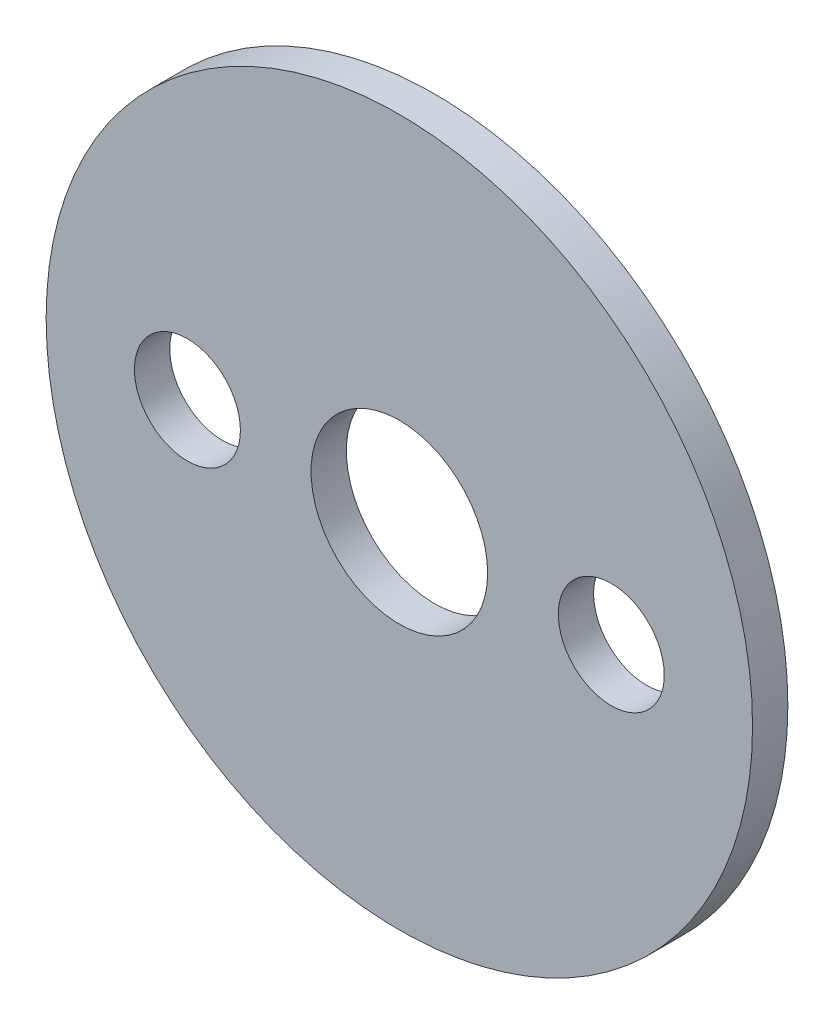
ISO-10303-21;
HEADER;
FILE_DESCRIPTION(('STEP AP214'),'2;1');
FILE_NAME('part.step','',(''),(''),'','','');
FILE_SCHEMA(('AUTOMOTIVE_DESIGN { 1 0 10303 214 1 1 1 1 }'));
ENDSEC;
DATA;
#1=APPLICATION_CONTEXT('core data for automotive mechanical design processes');
#2=APPLICATION_PROTOCOL_DEFINITION('international standard','automotive_design',2000,#1);
#3=PRODUCT_CONTEXT('',#1,'mechanical');
#4=PRODUCT('Part','Part','',(#3));
#5=PRODUCT_RELATED_PRODUCT_CATEGORY('part','',(#4));
#6=PRODUCT_DEFINITION_FORMATION('','',#4);
#7=PRODUCT_DEFINITION_CONTEXT('part definition',#1,'design');
#8=PRODUCT_DEFINITION('design','',#6,#7);
#9=PRODUCT_DEFINITION_SHAPE('','',#8);
#10=(LENGTH_UNIT() NAMED_UNIT(*) SI_UNIT(.MILLI.,.METRE.));
#11=(NAMED_UNIT(*) PLANE_ANGLE_UNIT() SI_UNIT($,.RADIAN.));
#12=(NAMED_UNIT(*) SI_UNIT($,.STERADIAN.) SOLID_ANGLE_UNIT());
#13=UNCERTAINTY_MEASURE_WITH_UNIT(LENGTH_MEASURE(1.E-05),#10,'distance_accuracy_value','');
#14=(GEOMETRIC_REPRESENTATION_CONTEXT(3) GLOBAL_UNCERTAINTY_ASSIGNED_CONTEXT((#13)) GLOBAL_UNIT_ASSIGNED_CONTEXT((#10,
#11,#12)) REPRESENTATION_CONTEXT('',''));
#15=CARTESIAN_POINT('',(0.,0.,0.));
#16=DIRECTION('',(0.,0.,1.));
#17=DIRECTION('',(1.,0.,0.));
#18=AXIS2_PLACEMENT_3D('',#15,#16,#17);
#19=CARTESIAN_POINT('',(0.,0.,0.25));
#20=DIRECTION('',(0.,0.,1.));
#21=DIRECTION('',(1.,0.,0.));
#22=AXIS2_PLACEMENT_3D('',#19,#20,#21);
#23=PLANE('',#22);
#24=CARTESIAN_POINT('',(-1.5,0.,0.25));
#25=DIRECTION('',(0.,0.,1.));
#26=DIRECTION('',(1.,0.,0.));
#27=AXIS2_PLACEMENT_3D('',#24,#25,#26);
#28=CIRCLE('',#27,0.375);
#29=CARTESIAN_POINT('',(-1.125,0.,0.25));
#30=VERTEX_POINT('',#29);
#31=EDGE_CURVE('E66',#30,#30,#28,.T.);
#32=ORIENTED_EDGE('',*,*,#31,.F.);
#33=EDGE_LOOP('',(#32));
#34=FACE_BOUND('',#33,.T.);
#35=CARTESIAN_POINT('',(1.5,0.,0.25));
#36=DIRECTION('',(0.,0.,1.));
#37=DIRECTION('',(1.,0.,0.));
#38=AXIS2_PLACEMENT_3D('',#35,#36,#37);
#39=CIRCLE('',#38,0.375);
#40=CARTESIAN_POINT('',(1.875,0.,0.25));
#41=VERTEX_POINT('',#40);
#42=EDGE_CURVE('E60',#41,#41,#39,.T.);
#43=ORIENTED_EDGE('',*,*,#42,.F.);
#44=EDGE_LOOP('',(#43));
#45=FACE_BOUND('',#44,.T.);
#46=CARTESIAN_POINT('',(0.,0.,0.25));
#47=DIRECTION('',(0.,0.,1.));
#48=DIRECTION('',(1.,0.,0.));
#49=AXIS2_PLACEMENT_3D('',#46,#47,#48);
#50=CIRCLE('',#49,2.5);
#51=CARTESIAN_POINT('',(2.5,0.,0.25));
#52=VERTEX_POINT('',#51);
#53=EDGE_CURVE('E10',#52,#52,#50,.T.);
#54=ORIENTED_EDGE('',*,*,#53,.T.);
#55=EDGE_LOOP('',(#54));
#56=FACE_BOUND('',#55,.T.);
#57=CARTESIAN_POINT('',(0.,0.,0.25));
#58=DIRECTION('',(0.,0.,1.));
#59=DIRECTION('',(1.,0.,0.));
#60=AXIS2_PLACEMENT_3D('',#57,#58,#59);
#61=CIRCLE('',#60,0.625);
#62=CARTESIAN_POINT('',(0.625,0.,0.25));
#63=VERTEX_POINT('',#62);
#64=EDGE_CURVE('E50',#63,#63,#61,.T.);
#65=ORIENTED_EDGE('',*,*,#64,.F.);
#66=EDGE_LOOP('',(#65));
#67=FACE_BOUND('',#66,.T.);
#68=ADVANCED_FACE('F39',(#34,#45,#56,#67),#23,.T.);
#69=CARTESIAN_POINT('',(0.,0.,0.));
#70=DIRECTION('',(0.,0.,1.));
#71=DIRECTION('',(1.,0.,0.));
#72=AXIS2_PLACEMENT_3D('',#69,#70,#71);
#73=PLANE('',#72);
#74=CARTESIAN_POINT('',(-1.5,0.,0.));
#75=DIRECTION('',(0.,0.,1.));
#76=DIRECTION('',(1.,0.,0.));
#77=AXIS2_PLACEMENT_3D('',#74,#75,#76);
#78=CIRCLE('',#77,0.375);
#79=CARTESIAN_POINT('',(-1.125,0.,0.));
#80=VERTEX_POINT('',#79);
#81=EDGE_CURVE('E63',#80,#80,#78,.T.);
#82=ORIENTED_EDGE('',*,*,#81,.T.);
#83=EDGE_LOOP('',(#82));
#84=FACE_BOUND('',#83,.T.);
#85=CARTESIAN_POINT('',(1.5,0.,0.));
#86=DIRECTION('',(0.,0.,1.));
#87=DIRECTION('',(1.,0.,0.));
#88=AXIS2_PLACEMENT_3D('',#85,#86,#87);
#89=CIRCLE('',#88,0.375);
#90=CARTESIAN_POINT('',(1.875,0.,0.));
#91=VERTEX_POINT('',#90);
#92=EDGE_CURVE('E55',#91,#91,#89,.T.);
#93=ORIENTED_EDGE('',*,*,#92,.T.);
#94=EDGE_LOOP('',(#93));
#95=FACE_BOUND('',#94,.T.);
#96=CARTESIAN_POINT('',(0.,0.,0.));
#97=DIRECTION('',(0.,0.,1.));
#98=DIRECTION('',(1.,0.,0.));
#99=AXIS2_PLACEMENT_3D('',#96,#97,#98);
#100=CIRCLE('',#99,2.5);
#101=CARTESIAN_POINT('',(2.5,0.,0.));
#102=VERTEX_POINT('',#101);
#103=EDGE_CURVE('E43',#102,#102,#100,.T.);
#104=ORIENTED_EDGE('',*,*,#103,.F.);
#105=EDGE_LOOP('',(#104));
#106=FACE_BOUND('',#105,.T.);
#107=CARTESIAN_POINT('',(0.,0.,0.));
#108=DIRECTION('',(0.,0.,1.));
#109=DIRECTION('',(1.,0.,0.));
#110=AXIS2_PLACEMENT_3D('',#107,#108,#109);
#111=CIRCLE('',#110,0.625);
#112=CARTESIAN_POINT('',(0.625,0.,0.));
#113=VERTEX_POINT('',#112);
#114=EDGE_CURVE('E52',#113,#113,#111,.T.);
#115=ORIENTED_EDGE('',*,*,#114,.T.);
#116=EDGE_LOOP('',(#115));
#117=FACE_BOUND('',#116,.T.);
#118=ADVANCED_FACE('F74',(#84,#95,#106,#117),#73,.F.);
#119=CARTESIAN_POINT('',(0.,0.,0.25));
#120=DIRECTION('',(0.,0.,-1.));
#121=DIRECTION('',(-1.,0.,0.));
#122=AXIS2_PLACEMENT_3D('',#119,#120,#121);
#123=CYLINDRICAL_SURFACE('',#122,2.5);
#124=ORIENTED_EDGE('',*,*,#53,.F.);
#125=EDGE_LOOP('',(#124));
#126=FACE_BOUND('',#125,.T.);
#127=ORIENTED_EDGE('',*,*,#103,.T.);
#128=EDGE_LOOP('',(#127));
#129=FACE_BOUND('',#128,.T.);
#130=ADVANCED_FACE('F41',(#126,#129),#123,.T.);
#131=CARTESIAN_POINT('',(0.,0.,0.25));
#132=DIRECTION('',(0.,0.,-1.));
#133=DIRECTION('',(-1.,0.,0.));
#134=AXIS2_PLACEMENT_3D('',#131,#132,#133);
#135=CYLINDRICAL_SURFACE('',#134,0.625);
#136=ORIENTED_EDGE('',*,*,#64,.T.);
#137=EDGE_LOOP('',(#136));
#138=FACE_BOUND('',#137,.T.);
#139=ORIENTED_EDGE('',*,*,#114,.F.);
#140=EDGE_LOOP('',(#139));
#141=FACE_BOUND('',#140,.T.);
#142=ADVANCED_FACE('F80',(#138,#141),#135,.F.);
#143=CARTESIAN_POINT('',(1.5,0.,0.25));
#144=DIRECTION('',(0.,0.,1.));
#145=DIRECTION('',(1.,0.,0.));
#146=AXIS2_PLACEMENT_3D('',#143,#144,#145);
#147=CYLINDRICAL_SURFACE('',#146,0.375);
#148=ORIENTED_EDGE('',*,*,#92,.F.);
#149=EDGE_LOOP('',(#148));
#150=FACE_BOUND('',#149,.T.);
#151=ORIENTED_EDGE('',*,*,#42,.T.);
#152=EDGE_LOOP('',(#151));
#153=FACE_BOUND('',#152,.T.);
#154=ADVANCED_FACE('F83',(#150,#153),#147,.F.);
#155=CARTESIAN_POINT('',(-1.5,0.,0.25));
#156=DIRECTION('',(0.,0.,1.));
#157=DIRECTION('',(1.,0.,0.));
#158=AXIS2_PLACEMENT_3D('',#155,#156,#157);
#159=CYLINDRICAL_SURFACE('',#158,0.375);
#160=ORIENTED_EDGE('',*,*,#81,.F.);
#161=EDGE_LOOP('',(#160));
#162=FACE_BOUND('',#161,.T.);
#163=ORIENTED_EDGE('',*,*,#31,.T.);
#164=EDGE_LOOP('',(#163));
#165=FACE_BOUND('',#164,.T.);
#166=ADVANCED_FACE('F70',(#162,#165),#159,.F.);
#167=CLOSED_SHELL('',(#68,#118,#130,#142,#154,#166));
#168=MANIFOLD_SOLID_BREP('B2',#167);
#169=ADVANCED_BREP_SHAPE_REPRESENTATION('',(#18,#168),#14);
#170=SHAPE_DEFINITION_REPRESENTATION(#9,#169);
ENDSEC;
END-ISO-10303-21;
